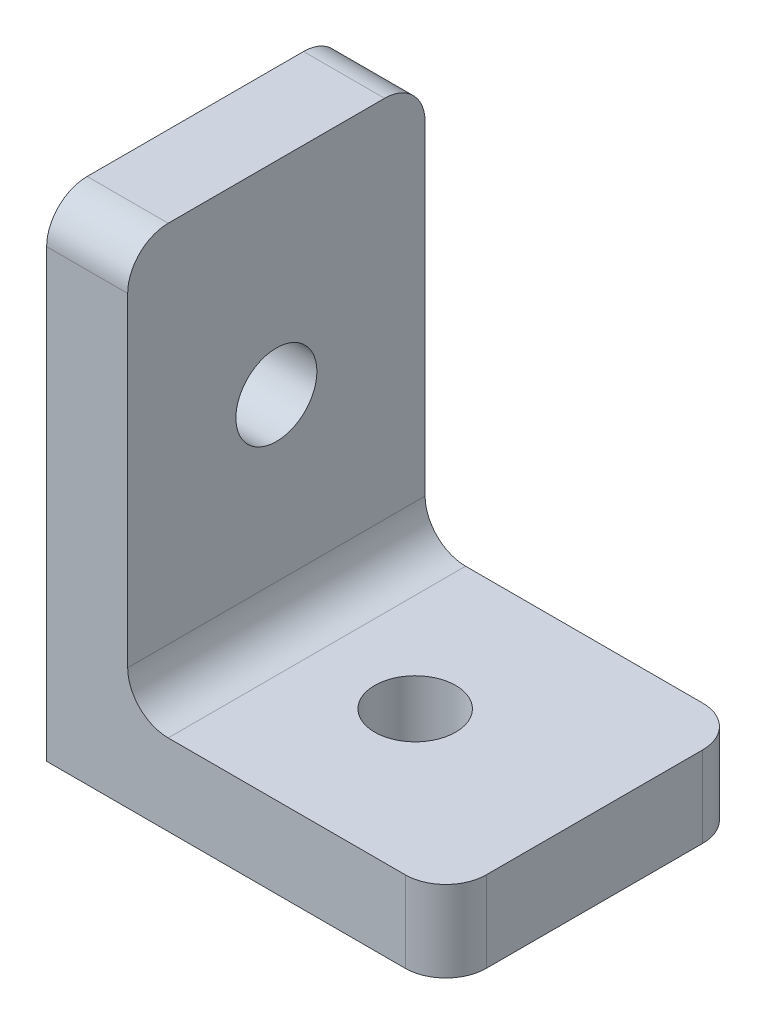
ISO-10303-21;
HEADER;
FILE_DESCRIPTION(('STEP AP214'),'2;1');
FILE_NAME('part.step','',(''),(''),'','','');
FILE_SCHEMA(('AUTOMOTIVE_DESIGN { 1 0 10303 214 1 1 1 1 }'));
ENDSEC;
DATA;
#1=APPLICATION_CONTEXT('core data for automotive mechanical design processes');
#2=APPLICATION_PROTOCOL_DEFINITION('international standard','automotive_design',2000,#1);
#3=PRODUCT_CONTEXT('',#1,'mechanical');
#4=PRODUCT('Part','Part','',(#3));
#5=PRODUCT_RELATED_PRODUCT_CATEGORY('part','',(#4));
#6=PRODUCT_DEFINITION_FORMATION('','',#4);
#7=PRODUCT_DEFINITION_CONTEXT('part definition',#1,'design');
#8=PRODUCT_DEFINITION('design','',#6,#7);
#9=PRODUCT_DEFINITION_SHAPE('','',#8);
#10=(LENGTH_UNIT() NAMED_UNIT(*) SI_UNIT(.MILLI.,.METRE.));
#11=(NAMED_UNIT(*) PLANE_ANGLE_UNIT() SI_UNIT($,.RADIAN.));
#12=(NAMED_UNIT(*) SI_UNIT($,.STERADIAN.) SOLID_ANGLE_UNIT());
#13=UNCERTAINTY_MEASURE_WITH_UNIT(LENGTH_MEASURE(1.E-05),#10,'distance_accuracy_value','');
#14=(GEOMETRIC_REPRESENTATION_CONTEXT(3) GLOBAL_UNCERTAINTY_ASSIGNED_CONTEXT((#13)) GLOBAL_UNIT_ASSIGNED_CONTEXT((#10,
#11,#12)) REPRESENTATION_CONTEXT('',''));
#15=CARTESIAN_POINT('',(0.,0.,0.));
#16=DIRECTION('',(0.,0.,1.));
#17=DIRECTION('',(1.,0.,0.));
#18=AXIS2_PLACEMENT_3D('',#15,#16,#17);
#19=CARTESIAN_POINT('',(0.,4.,0.));
#20=DIRECTION('',(0.,-1.,0.));
#21=DIRECTION('',(0.,0.,-1.));
#22=AXIS2_PLACEMENT_3D('',#19,#20,#21);
#23=PLANE('',#22);
#24=CARTESIAN_POINT('',(1.91974334468053,4.,-1.91078082726932));
#25=DIRECTION('',(0.,1.,0.));
#26=DIRECTION('',(0.,0.,1.));
#27=AXIS2_PLACEMENT_3D('',#24,#25,#26);
#28=CIRCLE('',#27,2.);
#29=CARTESIAN_POINT('',(1.91974334468053,4.,0.0892191727306776));
#30=VERTEX_POINT('',#29);
#31=EDGE_CURVE('E144',#30,#30,#28,.T.);
#32=ORIENTED_EDGE('',*,*,#31,.F.);
#33=EDGE_LOOP('',(#32));
#34=FACE_BOUND('',#33,.T.);
#35=DIRECTION('',(-1.,0.,0.));
#36=VECTOR('',#35,1.);
#37=CARTESIAN_POINT('',(-8.93062773171946,4.,-9.25078082726932));
#38=LINE('',#37,#36);
#39=CARTESIAN_POINT('',(8.77011441828054,4.,-9.25078082726932));
#40=VERTEX_POINT('',#39);
#41=CARTESIAN_POINT('',(-2.93062773171946,4.,-9.25078082726932));
#42=VERTEX_POINT('',#41);
#43=EDGE_CURVE('E150',#40,#42,#38,.T.);
#44=ORIENTED_EDGE('',*,*,#43,.T.);
#45=DIRECTION('',(0.,0.,-1.));
#46=VECTOR('',#45,1.);
#47=CARTESIAN_POINT('',(-2.93062773171946,4.,5.42921917273068));
#48=LINE('',#47,#46);
#49=CARTESIAN_POINT('',(-2.93062773171946,4.,5.42921917273068));
#50=VERTEX_POINT('',#49);
#51=EDGE_CURVE('E169',#42,#50,#48,.F.);
#52=ORIENTED_EDGE('',*,*,#51,.T.);
#53=DIRECTION('',(1.,0.,0.));
#54=VECTOR('',#53,1.);
#55=CARTESIAN_POINT('',(10.7701144182805,4.,5.42921917273068));
#56=LINE('',#55,#54);
#57=CARTESIAN_POINT('',(8.77011441828054,4.,5.42921917273068));
#58=VERTEX_POINT('',#57);
#59=EDGE_CURVE('E157',#50,#58,#56,.T.);
#60=ORIENTED_EDGE('',*,*,#59,.T.);
#61=CARTESIAN_POINT('',(8.77011441828054,4.,3.42921917273068));
#62=DIRECTION('',(0.,-1.,0.));
#63=DIRECTION('',(0.,0.,-1.));
#64=AXIS2_PLACEMENT_3D('',#61,#62,#63);
#65=CIRCLE('',#64,2.);
#66=CARTESIAN_POINT('',(10.7701144182805,4.,3.42921917273068));
#67=VERTEX_POINT('',#66);
#68=EDGE_CURVE('E167',#58,#67,#65,.F.);
#69=ORIENTED_EDGE('',*,*,#68,.T.);
#70=DIRECTION('',(0.,0.,-1.));
#71=VECTOR('',#70,1.);
#72=CARTESIAN_POINT('',(10.7701144182805,4.,5.42921917273068));
#73=LINE('',#72,#71);
#74=CARTESIAN_POINT('',(10.7701144182805,4.,-7.25078082726932));
#75=VERTEX_POINT('',#74);
#76=EDGE_CURVE('E209',#67,#75,#73,.T.);
#77=ORIENTED_EDGE('',*,*,#76,.T.);
#78=CARTESIAN_POINT('',(8.77011441828054,4.,-7.25078082726932));
#79=DIRECTION('',(0.,-1.,0.));
#80=DIRECTION('',(0.,0.,-1.));
#81=AXIS2_PLACEMENT_3D('',#78,#79,#80);
#82=CIRCLE('',#81,2.);
#83=EDGE_CURVE('E165',#75,#40,#82,.F.);
#84=ORIENTED_EDGE('',*,*,#83,.T.);
#85=EDGE_LOOP('',(#44,#52,#60,#69,#77,#84));
#86=FACE_BOUND('',#85,.T.);
#87=ADVANCED_FACE('F35',(#34,#86),#23,.F.);
#88=CARTESIAN_POINT('',(0.,0.,0.));
#89=DIRECTION('',(0.,-1.,0.));
#90=DIRECTION('',(0.,0.,-1.));
#91=AXIS2_PLACEMENT_3D('',#88,#89,#90);
#92=PLANE('',#91);
#93=DIRECTION('',(0.,0.,-1.));
#94=VECTOR('',#93,1.);
#95=CARTESIAN_POINT('',(10.7701144182805,0.,5.42921917273068));
#96=LINE('',#95,#94);
#97=CARTESIAN_POINT('',(10.7701144182805,0.,3.42921917273068));
#98=VERTEX_POINT('',#97);
#99=CARTESIAN_POINT('',(10.7701144182805,0.,-7.25078082726932));
#100=VERTEX_POINT('',#99);
#101=EDGE_CURVE('E139',#98,#100,#96,.T.);
#102=ORIENTED_EDGE('',*,*,#101,.F.);
#103=CARTESIAN_POINT('',(8.77011441828054,0.,3.42921917273068));
#104=DIRECTION('',(0.,-1.,0.));
#105=DIRECTION('',(0.,0.,-1.));
#106=AXIS2_PLACEMENT_3D('',#103,#104,#105);
#107=CIRCLE('',#106,2.);
#108=CARTESIAN_POINT('',(8.77011441828054,0.,5.42921917273068));
#109=VERTEX_POINT('',#108);
#110=EDGE_CURVE('E138',#98,#109,#107,.T.);
#111=ORIENTED_EDGE('',*,*,#110,.T.);
#112=DIRECTION('',(1.,0.,0.));
#113=VECTOR('',#112,1.);
#114=CARTESIAN_POINT('',(10.7701144182805,0.,5.42921917273068));
#115=LINE('',#114,#113);
#116=CARTESIAN_POINT('',(-8.93062773171946,0.,5.42921917273068));
#117=VERTEX_POINT('',#116);
#118=EDGE_CURVE('E122',#117,#109,#115,.T.);
#119=ORIENTED_EDGE('',*,*,#118,.F.);
#120=DIRECTION('',(0.,0.,1.));
#121=VECTOR('',#120,1.);
#122=CARTESIAN_POINT('',(-8.93062773171946,0.,-9.25078082726932));
#123=LINE('',#122,#121);
#124=CARTESIAN_POINT('',(-8.93062773171946,0.,-9.25078082726932));
#125=VERTEX_POINT('',#124);
#126=EDGE_CURVE('E137',#125,#117,#123,.T.);
#127=ORIENTED_EDGE('',*,*,#126,.F.);
#128=DIRECTION('',(-1.,0.,0.));
#129=VECTOR('',#128,1.);
#130=CARTESIAN_POINT('',(-8.93062773171946,0.,-9.25078082726932));
#131=LINE('',#130,#129);
#132=CARTESIAN_POINT('',(8.77011441828054,0.,-9.25078082726932));
#133=VERTEX_POINT('',#132);
#134=EDGE_CURVE('E155',#133,#125,#131,.T.);
#135=ORIENTED_EDGE('',*,*,#134,.F.);
#136=CARTESIAN_POINT('',(8.77011441828054,0.,-7.25078082726932));
#137=DIRECTION('',(0.,-1.,0.));
#138=DIRECTION('',(0.,0.,-1.));
#139=AXIS2_PLACEMENT_3D('',#136,#137,#138);
#140=CIRCLE('',#139,2.);
#141=EDGE_CURVE('E176',#133,#100,#140,.T.);
#142=ORIENTED_EDGE('',*,*,#141,.T.);
#143=EDGE_LOOP('',(#102,#111,#119,#127,#135,#142));
#144=FACE_BOUND('',#143,.T.);
#145=CARTESIAN_POINT('',(1.91974334468053,0.,-1.91078082726932));
#146=DIRECTION('',(0.,1.,0.));
#147=DIRECTION('',(0.,0.,1.));
#148=AXIS2_PLACEMENT_3D('',#145,#146,#147);
#149=CIRCLE('',#148,2.);
#150=CARTESIAN_POINT('',(1.91974334468053,0.,0.0892191727306776));
#151=VERTEX_POINT('',#150);
#152=EDGE_CURVE('E147',#151,#151,#149,.T.);
#153=ORIENTED_EDGE('',*,*,#152,.T.);
#154=EDGE_LOOP('',(#153));
#155=FACE_BOUND('',#154,.T.);
#156=ADVANCED_FACE('F134',(#144,#155),#92,.T.);
#157=CARTESIAN_POINT('',(-8.93062773171946,4.,-9.25078082726932));
#158=DIRECTION('',(1.,0.,0.));
#159=DIRECTION('',(0.,0.,-1.));
#160=AXIS2_PLACEMENT_3D('',#157,#158,#159);
#161=PLANE('',#160);
#162=CARTESIAN_POINT('',(-8.93062773171946,14.,-1.91078082726932));
#163=DIRECTION('',(1.,0.,0.));
#164=DIRECTION('',(0.,0.,-1.));
#165=AXIS2_PLACEMENT_3D('',#162,#163,#164);
#166=CIRCLE('',#165,2.);
#167=CARTESIAN_POINT('',(-8.93062773171946,14.,-3.91078082726932));
#168=VERTEX_POINT('',#167);
#169=EDGE_CURVE('E268',#168,#168,#166,.T.);
#170=ORIENTED_EDGE('',*,*,#169,.T.);
#171=EDGE_LOOP('',(#170));
#172=FACE_BOUND('',#171,.T.);
#173=DIRECTION('',(0.,-1.,0.));
#174=VECTOR('',#173,1.);
#175=CARTESIAN_POINT('',(-8.93062773171946,4.,5.42921917273068));
#176=LINE('',#175,#174);
#177=CARTESIAN_POINT('',(-8.93062773171946,22.,5.42921917273068));
#178=VERTEX_POINT('',#177);
#179=EDGE_CURVE('E119',#178,#117,#176,.T.);
#180=ORIENTED_EDGE('',*,*,#179,.F.);
#181=CARTESIAN_POINT('',(-8.93062773171946,22.,3.42921917273068));
#182=DIRECTION('',(1.,0.,0.));
#183=DIRECTION('',(0.,0.,-1.));
#184=AXIS2_PLACEMENT_3D('',#181,#182,#183);
#185=CIRCLE('',#184,2.);
#186=CARTESIAN_POINT('',(-8.93062773171946,24.,3.42921917273068));
#187=VERTEX_POINT('',#186);
#188=EDGE_CURVE('E50',#178,#187,#185,.F.);
#189=ORIENTED_EDGE('',*,*,#188,.T.);
#190=DIRECTION('',(0.,0.,1.));
#191=VECTOR('',#190,1.);
#192=CARTESIAN_POINT('',(-8.93062773171946,24.,-9.25078082726932));
#193=LINE('',#192,#191);
#194=CARTESIAN_POINT('',(-8.93062773171946,24.,-7.25078082726932));
#195=VERTEX_POINT('',#194);
#196=EDGE_CURVE('E270',#195,#187,#193,.T.);
#197=ORIENTED_EDGE('',*,*,#196,.F.);
#198=CARTESIAN_POINT('',(-8.93062773171946,22.,-7.25078082726932));
#199=DIRECTION('',(1.,0.,0.));
#200=DIRECTION('',(0.,0.,-1.));
#201=AXIS2_PLACEMENT_3D('',#198,#199,#200);
#202=CIRCLE('',#201,2.);
#203=CARTESIAN_POINT('',(-8.93062773171946,22.,-9.25078082726932));
#204=VERTEX_POINT('',#203);
#205=EDGE_CURVE('E58',#195,#204,#202,.F.);
#206=ORIENTED_EDGE('',*,*,#205,.T.);
#207=DIRECTION('',(0.,-1.,0.));
#208=VECTOR('',#207,1.);
#209=CARTESIAN_POINT('',(-8.93062773171946,4.,-9.25078082726932));
#210=LINE('',#209,#208);
#211=EDGE_CURVE('E129',#204,#125,#210,.T.);
#212=ORIENTED_EDGE('',*,*,#211,.T.);
#213=ORIENTED_EDGE('',*,*,#126,.T.);
#214=EDGE_LOOP('',(#180,#189,#197,#206,#212,#213));
#215=FACE_BOUND('',#214,.T.);
#216=ADVANCED_FACE('F141',(#172,#215),#161,.F.);
#217=CARTESIAN_POINT('',(10.7701144182805,4.,5.42921917273068));
#218=DIRECTION('',(0.,0.,-1.));
#219=DIRECTION('',(-1.,0.,0.));
#220=AXIS2_PLACEMENT_3D('',#217,#218,#219);
#221=PLANE('',#220);
#222=ORIENTED_EDGE('',*,*,#118,.T.);
#223=DIRECTION('',(0.,-1.,0.));
#224=VECTOR('',#223,1.);
#225=CARTESIAN_POINT('',(8.77011441828054,4.,5.42921917273068));
#226=LINE('',#225,#224);
#227=EDGE_CURVE('E180',#109,#58,#226,.F.);
#228=ORIENTED_EDGE('',*,*,#227,.T.);
#229=ORIENTED_EDGE('',*,*,#59,.F.);
#230=CARTESIAN_POINT('',(-2.93062773171946,6.,5.42921917273068));
#231=DIRECTION('',(0.,0.,-1.));
#232=DIRECTION('',(-1.,0.,0.));
#233=AXIS2_PLACEMENT_3D('',#230,#231,#232);
#234=CIRCLE('',#233,2.);
#235=CARTESIAN_POINT('',(-4.93062773171946,6.,5.42921917273068));
#236=VERTEX_POINT('',#235);
#237=EDGE_CURVE('E11',#50,#236,#234,.T.);
#238=ORIENTED_EDGE('',*,*,#237,.T.);
#239=DIRECTION('',(0.,-1.,0.));
#240=VECTOR('',#239,1.);
#241=CARTESIAN_POINT('',(-4.93062773171946,24.,5.42921917273068));
#242=LINE('',#241,#240);
#243=CARTESIAN_POINT('',(-4.93062773171946,22.,5.42921917273068));
#244=VERTEX_POINT('',#243);
#245=EDGE_CURVE('E213',#244,#236,#242,.T.);
#246=ORIENTED_EDGE('',*,*,#245,.F.);
#247=DIRECTION('',(1.,0.,0.));
#248=VECTOR('',#247,1.);
#249=CARTESIAN_POINT('',(-8.93062773171946,22.,5.42921917273068));
#250=LINE('',#249,#248);
#251=EDGE_CURVE('E126',#244,#178,#250,.F.);
#252=ORIENTED_EDGE('',*,*,#251,.T.);
#253=ORIENTED_EDGE('',*,*,#179,.T.);
#254=EDGE_LOOP('',(#222,#228,#229,#238,#246,#252,#253));
#255=FACE_BOUND('',#254,.T.);
#256=ADVANCED_FACE('F121',(#255),#221,.F.);
#257=CARTESIAN_POINT('',(10.7701144182805,4.,5.42921917273068));
#258=DIRECTION('',(-1.,0.,0.));
#259=DIRECTION('',(0.,0.,1.));
#260=AXIS2_PLACEMENT_3D('',#257,#258,#259);
#261=PLANE('',#260);
#262=ORIENTED_EDGE('',*,*,#76,.F.);
#263=DIRECTION('',(0.,-1.,0.));
#264=VECTOR('',#263,1.);
#265=CARTESIAN_POINT('',(10.7701144182805,4.,3.42921917273068));
#266=LINE('',#265,#264);
#267=EDGE_CURVE('E173',#67,#98,#266,.T.);
#268=ORIENTED_EDGE('',*,*,#267,.T.);
#269=ORIENTED_EDGE('',*,*,#101,.T.);
#270=DIRECTION('',(0.,-1.,0.));
#271=VECTOR('',#270,1.);
#272=CARTESIAN_POINT('',(10.7701144182805,4.,-7.25078082726932));
#273=LINE('',#272,#271);
#274=EDGE_CURVE('E171',#100,#75,#273,.F.);
#275=ORIENTED_EDGE('',*,*,#274,.T.);
#276=EDGE_LOOP('',(#262,#268,#269,#275));
#277=FACE_BOUND('',#276,.T.);
#278=ADVANCED_FACE('F231',(#277),#261,.F.);
#279=CARTESIAN_POINT('',(-8.93062773171946,4.,-9.25078082726932));
#280=DIRECTION('',(0.,0.,1.));
#281=DIRECTION('',(1.,0.,0.));
#282=AXIS2_PLACEMENT_3D('',#279,#280,#281);
#283=PLANE('',#282);
#284=ORIENTED_EDGE('',*,*,#43,.F.);
#285=DIRECTION('',(0.,-1.,0.));
#286=VECTOR('',#285,1.);
#287=CARTESIAN_POINT('',(8.77011441828054,4.,-9.25078082726932));
#288=LINE('',#287,#286);
#289=EDGE_CURVE('E184',#40,#133,#288,.T.);
#290=ORIENTED_EDGE('',*,*,#289,.T.);
#291=ORIENTED_EDGE('',*,*,#134,.T.);
#292=ORIENTED_EDGE('',*,*,#211,.F.);
#293=DIRECTION('',(-1.,0.,0.));
#294=VECTOR('',#293,1.);
#295=CARTESIAN_POINT('',(-4.93062773171946,22.,-9.25078082726932));
#296=LINE('',#295,#294);
#297=CARTESIAN_POINT('',(-4.93062773171946,22.,-9.25078082726932));
#298=VERTEX_POINT('',#297);
#299=EDGE_CURVE('E182',#204,#298,#296,.F.);
#300=ORIENTED_EDGE('',*,*,#299,.T.);
#301=DIRECTION('',(0.,-1.,0.));
#302=VECTOR('',#301,1.);
#303=CARTESIAN_POINT('',(-4.93062773171946,24.,-9.25078082726932));
#304=LINE('',#303,#302);
#305=CARTESIAN_POINT('',(-4.93062773171946,6.,-9.25078082726932));
#306=VERTEX_POINT('',#305);
#307=EDGE_CURVE('E200',#298,#306,#304,.T.);
#308=ORIENTED_EDGE('',*,*,#307,.T.);
#309=CARTESIAN_POINT('',(-2.93062773171946,6.,-9.25078082726932));
#310=DIRECTION('',(0.,0.,1.));
#311=DIRECTION('',(1.,0.,0.));
#312=AXIS2_PLACEMENT_3D('',#309,#310,#311);
#313=CIRCLE('',#312,2.);
#314=EDGE_CURVE('E43',#306,#42,#313,.T.);
#315=ORIENTED_EDGE('',*,*,#314,.T.);
#316=EDGE_LOOP('',(#284,#290,#291,#292,#300,#308,#315));
#317=FACE_BOUND('',#316,.T.);
#318=ADVANCED_FACE('F197',(#317),#283,.F.);
#319=CARTESIAN_POINT('',(1.91974334468053,4.,-1.91078082726932));
#320=DIRECTION('',(0.,-1.,0.));
#321=DIRECTION('',(0.,0.,-1.));
#322=AXIS2_PLACEMENT_3D('',#319,#320,#321);
#323=CYLINDRICAL_SURFACE('',#322,2.);
#324=ORIENTED_EDGE('',*,*,#31,.T.);
#325=EDGE_LOOP('',(#324));
#326=FACE_BOUND('',#325,.T.);
#327=ORIENTED_EDGE('',*,*,#152,.F.);
#328=EDGE_LOOP('',(#327));
#329=FACE_BOUND('',#328,.T.);
#330=ADVANCED_FACE('F253',(#326,#329),#323,.F.);
#331=CARTESIAN_POINT('',(-4.93062773171946,24.,-9.25078082726932));
#332=DIRECTION('',(-1.,0.,0.));
#333=DIRECTION('',(0.,0.,1.));
#334=AXIS2_PLACEMENT_3D('',#331,#332,#333);
#335=PLANE('',#334);
#336=CARTESIAN_POINT('',(-4.93062773171946,14.,-1.91078082726932));
#337=DIRECTION('',(1.,0.,0.));
#338=DIRECTION('',(0.,0.,-1.));
#339=AXIS2_PLACEMENT_3D('',#336,#337,#338);
#340=CIRCLE('',#339,2.);
#341=CARTESIAN_POINT('',(-4.93062773171946,14.,-3.91078082726932));
#342=VERTEX_POINT('',#341);
#343=EDGE_CURVE('E271',#342,#342,#340,.T.);
#344=ORIENTED_EDGE('',*,*,#343,.F.);
#345=EDGE_LOOP('',(#344));
#346=FACE_BOUND('',#345,.T.);
#347=ORIENTED_EDGE('',*,*,#245,.T.);
#348=DIRECTION('',(0.,0.,-1.));
#349=VECTOR('',#348,1.);
#350=CARTESIAN_POINT('',(-4.93062773171946,6.,-9.25078082726932));
#351=LINE('',#350,#349);
#352=EDGE_CURVE('E162',#236,#306,#351,.T.);
#353=ORIENTED_EDGE('',*,*,#352,.T.);
#354=ORIENTED_EDGE('',*,*,#307,.F.);
#355=CARTESIAN_POINT('',(-4.93062773171946,22.,-7.25078082726932));
#356=DIRECTION('',(-1.,0.,0.));
#357=DIRECTION('',(0.,0.,1.));
#358=AXIS2_PLACEMENT_3D('',#355,#356,#357);
#359=CIRCLE('',#358,2.);
#360=CARTESIAN_POINT('',(-4.93062773171946,24.,-7.25078082726932));
#361=VERTEX_POINT('',#360);
#362=EDGE_CURVE('E128',#298,#361,#359,.F.);
#363=ORIENTED_EDGE('',*,*,#362,.T.);
#364=DIRECTION('',(0.,0.,-1.));
#365=VECTOR('',#364,1.);
#366=CARTESIAN_POINT('',(-4.93062773171946,24.,-9.25078082726932));
#367=LINE('',#366,#365);
#368=CARTESIAN_POINT('',(-4.93062773171946,24.,3.42921917273068));
#369=VERTEX_POINT('',#368);
#370=EDGE_CURVE('E220',#369,#361,#367,.T.);
#371=ORIENTED_EDGE('',*,*,#370,.F.);
#372=CARTESIAN_POINT('',(-4.93062773171946,22.,3.42921917273068));
#373=DIRECTION('',(-1.,0.,0.));
#374=DIRECTION('',(0.,0.,1.));
#375=AXIS2_PLACEMENT_3D('',#372,#373,#374);
#376=CIRCLE('',#375,2.);
#377=EDGE_CURVE('E160',#369,#244,#376,.F.);
#378=ORIENTED_EDGE('',*,*,#377,.T.);
#379=EDGE_LOOP('',(#347,#353,#354,#363,#371,#378));
#380=FACE_BOUND('',#379,.T.);
#381=ADVANCED_FACE('F215',(#346,#380),#335,.F.);
#382=CARTESIAN_POINT('',(0.,24.,0.));
#383=DIRECTION('',(0.,1.,0.));
#384=DIRECTION('',(0.,0.,1.));
#385=AXIS2_PLACEMENT_3D('',#382,#383,#384);
#386=PLANE('',#385);
#387=ORIENTED_EDGE('',*,*,#196,.T.);
#388=DIRECTION('',(1.,0.,0.));
#389=VECTOR('',#388,1.);
#390=CARTESIAN_POINT('',(-4.93062773171946,24.,3.42921917273068));
#391=LINE('',#390,#389);
#392=EDGE_CURVE('E189',#187,#369,#391,.T.);
#393=ORIENTED_EDGE('',*,*,#392,.T.);
#394=ORIENTED_EDGE('',*,*,#370,.T.);
#395=DIRECTION('',(-1.,0.,0.));
#396=VECTOR('',#395,1.);
#397=CARTESIAN_POINT('',(-8.93062773171946,24.,-7.25078082726932));
#398=LINE('',#397,#396);
#399=EDGE_CURVE('E187',#361,#195,#398,.T.);
#400=ORIENTED_EDGE('',*,*,#399,.T.);
#401=EDGE_LOOP('',(#387,#393,#394,#400));
#402=FACE_BOUND('',#401,.T.);
#403=ADVANCED_FACE('F278',(#402),#386,.T.);
#404=CARTESIAN_POINT('',(-14.9306277317195,14.,-1.91078082726932));
#405=DIRECTION('',(1.,0.,0.));
#406=DIRECTION('',(0.,0.,-1.));
#407=AXIS2_PLACEMENT_3D('',#404,#405,#406);
#408=CYLINDRICAL_SURFACE('',#407,2.);
#409=ORIENTED_EDGE('',*,*,#343,.T.);
#410=EDGE_LOOP('',(#409));
#411=FACE_BOUND('',#410,.T.);
#412=ORIENTED_EDGE('',*,*,#169,.F.);
#413=EDGE_LOOP('',(#412));
#414=FACE_BOUND('',#413,.T.);
#415=ADVANCED_FACE('F242',(#411,#414),#408,.F.);
#416=CARTESIAN_POINT('',(-2.93062773171946,6.,-9.25078082726932));
#417=DIRECTION('',(0.,0.,1.));
#418=DIRECTION('',(1.,0.,0.));
#419=AXIS2_PLACEMENT_3D('',#416,#417,#418);
#420=CYLINDRICAL_SURFACE('',#419,2.);
#421=ORIENTED_EDGE('',*,*,#237,.F.);
#422=ORIENTED_EDGE('',*,*,#51,.F.);
#423=ORIENTED_EDGE('',*,*,#314,.F.);
#424=ORIENTED_EDGE('',*,*,#352,.F.);
#425=EDGE_LOOP('',(#421,#422,#423,#424));
#426=FACE_BOUND('',#425,.T.);
#427=ADVANCED_FACE('F211',(#426),#420,.F.);
#428=CARTESIAN_POINT('',(8.77011441828054,4.,3.42921917273068));
#429=DIRECTION('',(0.,-1.,0.));
#430=DIRECTION('',(0.,0.,-1.));
#431=AXIS2_PLACEMENT_3D('',#428,#429,#430);
#432=CYLINDRICAL_SURFACE('',#431,2.);
#433=ORIENTED_EDGE('',*,*,#68,.F.);
#434=ORIENTED_EDGE('',*,*,#227,.F.);
#435=ORIENTED_EDGE('',*,*,#110,.F.);
#436=ORIENTED_EDGE('',*,*,#267,.F.);
#437=EDGE_LOOP('',(#433,#434,#435,#436));
#438=FACE_BOUND('',#437,.T.);
#439=ADVANCED_FACE('F233',(#438),#432,.T.);
#440=CARTESIAN_POINT('',(8.77011441828054,4.,-7.25078082726932));
#441=DIRECTION('',(0.,-1.,0.));
#442=DIRECTION('',(0.,0.,-1.));
#443=AXIS2_PLACEMENT_3D('',#440,#441,#442);
#444=CYLINDRICAL_SURFACE('',#443,2.);
#445=ORIENTED_EDGE('',*,*,#83,.F.);
#446=ORIENTED_EDGE('',*,*,#274,.F.);
#447=ORIENTED_EDGE('',*,*,#141,.F.);
#448=ORIENTED_EDGE('',*,*,#289,.F.);
#449=EDGE_LOOP('',(#445,#446,#447,#448));
#450=FACE_BOUND('',#449,.T.);
#451=ADVANCED_FACE('F230',(#450),#444,.T.);
#452=CARTESIAN_POINT('',(0.,22.,3.42921917273068));
#453=DIRECTION('',(-1.,0.,0.));
#454=DIRECTION('',(0.,0.,1.));
#455=AXIS2_PLACEMENT_3D('',#452,#453,#454);
#456=CYLINDRICAL_SURFACE('',#455,2.);
#457=ORIENTED_EDGE('',*,*,#188,.F.);
#458=ORIENTED_EDGE('',*,*,#251,.F.);
#459=ORIENTED_EDGE('',*,*,#377,.F.);
#460=ORIENTED_EDGE('',*,*,#392,.F.);
#461=EDGE_LOOP('',(#457,#458,#459,#460));
#462=FACE_BOUND('',#461,.T.);
#463=ADVANCED_FACE('F240',(#462),#456,.T.);
#464=CARTESIAN_POINT('',(0.,22.,-7.25078082726932));
#465=DIRECTION('',(1.,0.,0.));
#466=DIRECTION('',(0.,0.,-1.));
#467=AXIS2_PLACEMENT_3D('',#464,#465,#466);
#468=CYLINDRICAL_SURFACE('',#467,2.);
#469=ORIENTED_EDGE('',*,*,#362,.F.);
#470=ORIENTED_EDGE('',*,*,#299,.F.);
#471=ORIENTED_EDGE('',*,*,#205,.F.);
#472=ORIENTED_EDGE('',*,*,#399,.F.);
#473=EDGE_LOOP('',(#469,#470,#471,#472));
#474=FACE_BOUND('',#473,.T.);
#475=ADVANCED_FACE('F37',(#474),#468,.T.);
#476=CLOSED_SHELL('',(#87,#156,#216,#256,#278,#318,#330,#381,#403,#415,#427,#439,#451,#463,#475));
#477=MANIFOLD_SOLID_BREP('B2',#476);
#478=ADVANCED_BREP_SHAPE_REPRESENTATION('',(#18,#477),#14);
#479=SHAPE_DEFINITION_REPRESENTATION(#9,#478);
ENDSEC;
END-ISO-10303-21;
